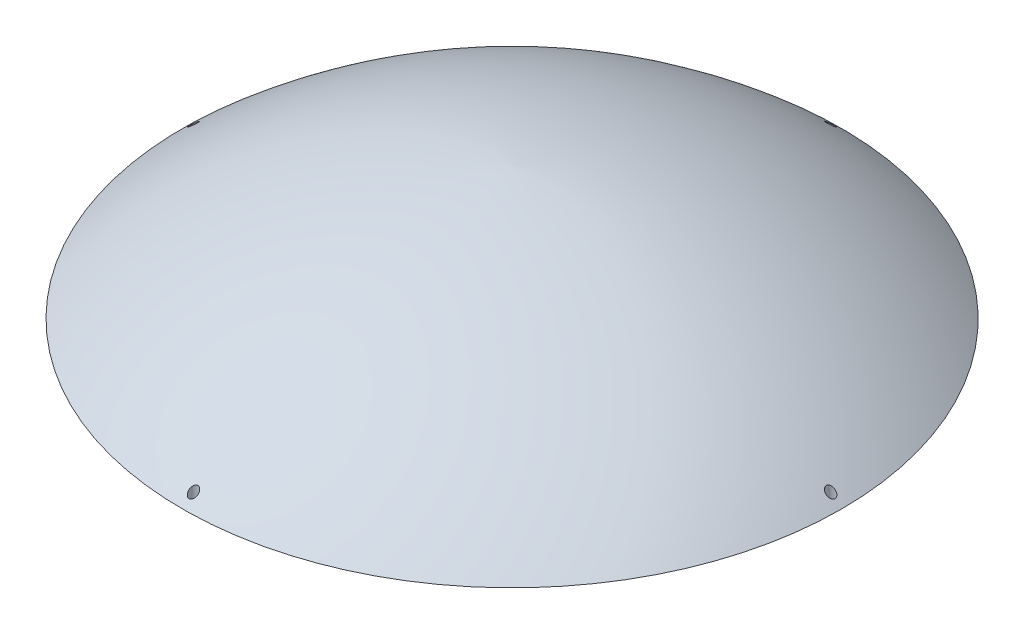
ISO-10303-21;
HEADER;
FILE_DESCRIPTION(('STEP AP214'),'2;1');
FILE_NAME('part.step','',(''),(''),'','','');
FILE_SCHEMA(('AUTOMOTIVE_DESIGN { 1 0 10303 214 1 1 1 1 }'));
ENDSEC;
DATA;
#1=APPLICATION_CONTEXT('core data for automotive mechanical design processes');
#2=APPLICATION_PROTOCOL_DEFINITION('international standard','automotive_design',2000,#1);
#3=PRODUCT_CONTEXT('',#1,'mechanical');
#4=PRODUCT('Part','Part','',(#3));
#5=PRODUCT_RELATED_PRODUCT_CATEGORY('part','',(#4));
#6=PRODUCT_DEFINITION_FORMATION('','',#4);
#7=PRODUCT_DEFINITION_CONTEXT('part definition',#1,'design');
#8=PRODUCT_DEFINITION('design','',#6,#7);
#9=PRODUCT_DEFINITION_SHAPE('','',#8);
#10=(LENGTH_UNIT() NAMED_UNIT(*) SI_UNIT(.MILLI.,.METRE.));
#11=(NAMED_UNIT(*) PLANE_ANGLE_UNIT() SI_UNIT($,.RADIAN.));
#12=(NAMED_UNIT(*) SI_UNIT($,.STERADIAN.) SOLID_ANGLE_UNIT());
#13=UNCERTAINTY_MEASURE_WITH_UNIT(LENGTH_MEASURE(1.E-05),#10,'distance_accuracy_value','');
#14=(GEOMETRIC_REPRESENTATION_CONTEXT(3) GLOBAL_UNCERTAINTY_ASSIGNED_CONTEXT((#13)) GLOBAL_UNIT_ASSIGNED_CONTEXT((#10,
#11,#12)) REPRESENTATION_CONTEXT('',''));
#15=CARTESIAN_POINT('',(0.,0.,0.));
#16=DIRECTION('',(0.,0.,1.));
#17=DIRECTION('',(1.,0.,0.));
#18=AXIS2_PLACEMENT_3D('',#15,#16,#17);
#19=CARTESIAN_POINT('',(-25.734910079613,-379.337275199032,0.));
#20=DIRECTION('',(0.,0.,-1.));
#21=DIRECTION('',(1.,0.,0.));
#22=AXIS2_PLACEMENT_3D('',#19,#20,#21);
#23=CIRCLE('',#22,500.);
#24=TRIMMED_CURVE('',#23,(PARAMETER_VALUE(-1.51930375435487)),
(PARAMETER_VALUE(1.51930375435487)),.T.,.PARAMETER.);
#25=CARTESIAN_POINT('',(0.,-379.337275199032,0.));
#26=DIRECTION('',(0.,-1.,0.));
#27=AXIS1_PLACEMENT('',#25,#26);
#28=SURFACE_OF_REVOLUTION('',#24,#27);
#29=CARTESIAN_POINT('',(292.267910012318,6.48962110392255,-3.2949331064573));
#30=CARTESIAN_POINT('',(292.036218045832,6.6791010805756,-3.45439942666228));
#31=CARTESIAN_POINT('',(291.792467635032,6.87831949702455,-3.58613931641101));
#32=CARTESIAN_POINT('',(291.416813464353,7.18512423822028,-3.74315767288164));
#33=CARTESIAN_POINT('',(291.289619994159,7.28896994773269,-3.78878968035923));
#34=CARTESIAN_POINT('',(291.032757390591,7.4986079612843,-3.86670268112892));
#35=CARTESIAN_POINT('',(290.903088789097,7.6043998469375,-3.89898650975481));
#36=CARTESIAN_POINT('',(290.513871026968,7.92183333053797,-3.97561515687187));
#37=CARTESIAN_POINT('',(290.251867799006,8.13536404002472,-4.00065283273166));
#38=CARTESIAN_POINT('',(289.72782097396,8.56215029133093,-3.9993213831094));
#39=CARTESIAN_POINT('',(289.465777383657,8.77540585884122,-3.97295746654852));
#40=CARTESIAN_POINT('',(289.064091278072,9.10207654610129,-3.89169504431107));
#41=CARTESIAN_POINT('',(288.922207400864,9.21741802944437,-3.85487189917686));
#42=CARTESIAN_POINT('',(288.641503438885,9.44552466567293,-3.76513434376763));
#43=CARTESIAN_POINT('',(288.502684002745,9.5582892733015,-3.71221656121235));
#44=CARTESIAN_POINT('',(288.093080327477,9.89089230363154,-3.52886741596773));
#45=CARTESIAN_POINT('',(287.828393184427,10.1056559310015,-3.37369368337503));
#46=CARTESIAN_POINT('',(287.412505644818,10.4428859627782,-3.05759749422192));
#47=CARTESIAN_POINT('',(287.252639139491,10.572454935075,-2.91539987014728));
#48=CARTESIAN_POINT('',(286.952522464417,10.8156015632706,-2.60001927716397));
#49=CARTESIAN_POINT('',(286.812241019364,10.929204716896,-2.42688674004844));
#50=CARTESIAN_POINT('',(286.581079711342,11.1163463437085,-2.08459726744605));
#51=CARTESIAN_POINT('',(286.485853034323,11.1934154501171,-1.92035220072776));
#52=CARTESIAN_POINT('',(286.359729876266,11.295469558445,-1.66064095266421));
#53=CARTESIAN_POINT('',(286.320463003938,11.3272390097345,-1.57180961301426));
#54=CARTESIAN_POINT('',(286.248053786278,11.385817564669,-1.39012511180292));
#55=CARTESIAN_POINT('',(286.214908744587,11.4126288521424,-1.29727374321395));
#56=CARTESIAN_POINT('',(286.155034746052,11.4610579634418,-1.10735477042745));
#57=CARTESIAN_POINT('',(286.128357975323,11.4826335465982,-1.0102598791584));
#58=CARTESIAN_POINT('',(286.082251191194,11.5199217521549,-0.813305433226634));
#59=CARTESIAN_POINT('',(286.062817588184,11.5356372787162,-0.713447274429294));
#60=CARTESIAN_POINT('',(286.031567361725,11.5609078456787,-0.511808083379131));
#61=CARTESIAN_POINT('',(286.019748154648,11.5704649756755,-0.410027715426245));
#62=CARTESIAN_POINT('',(286.00396424142,11.5832278731941,-0.205468881002917));
#63=CARTESIAN_POINT('',(285.999998563181,11.5864344267723,-0.102690539641578));
#64=CARTESIAN_POINT('',(286.000001261634,11.5864322409967,0.0902136062643329));
#65=CARTESIAN_POINT('',(286.003054133731,11.5839637574694,0.180341442198961));
#66=CARTESIAN_POINT('',(286.015211283645,11.5741335158454,0.359948344122502));
#67=CARTESIAN_POINT('',(286.024317451971,11.5667702290499,0.449427198599309));
#68=CARTESIAN_POINT('',(286.048434251885,11.547268499117,0.627018088593616));
#69=CARTESIAN_POINT('',(286.063442257767,11.5351321794835,0.715130713846184));
#70=CARTESIAN_POINT('',(286.099126561056,11.5062742358141,0.889447888673256));
#71=CARTESIAN_POINT('',(286.119805045767,11.4895508423815,0.975651688050446));
#72=CARTESIAN_POINT('',(286.189378213925,11.4332807675235,1.22858588559347));
#73=CARTESIAN_POINT('',(286.24612114683,11.3873831465826,1.39184564359416));
#74=CARTESIAN_POINT('',(286.377812772175,11.2808402496912,1.70551600983874));
#75=CARTESIAN_POINT('',(286.452765797987,11.2201914634694,1.85592354816579));
#76=CARTESIAN_POINT('',(286.628041369201,11.0783312983801,2.15969287514198));
#77=CARTESIAN_POINT('',(286.73034807054,10.9955101735742,2.31115391102913));
#78=CARTESIAN_POINT('',(286.950202667918,10.8174730930951,2.59441039456338));
#79=CARTESIAN_POINT('',(287.067763671212,10.7222464777235,2.72618871792441));
#80=CARTESIAN_POINT('',(287.374683811438,10.4735479021658,3.02886681264689));
#81=CARTESIAN_POINT('',(287.57121433528,10.314224546575,3.18774834718305));
#82=CARTESIAN_POINT('',(287.981611486035,9.98132989299367,3.46226235312698));
#83=CARTESIAN_POINT('',(288.195504186283,9.80773716108405,3.57782825761775));
#84=CARTESIAN_POINT('',(288.637011791421,9.4491953935222,3.76839898967525));
#85=CARTESIAN_POINT('',(288.864775623936,9.26412245223137,3.8428204138555));
#86=CARTESIAN_POINT('',(289.325920540663,8.88917308355763,3.94989539231856));
#87=CARTESIAN_POINT('',(289.559301899036,8.69929642170774,3.98254690380819));
#88=CARTESIAN_POINT('',(290.071536087071,8.28227930012672,4.00905395728494));
#89=CARTESIAN_POINT('',(290.350647398501,8.05487776825107,3.99441189991257));
#90=CARTESIAN_POINT('',(290.903317188981,7.60425763089688,3.90670022503772));
#91=CARTESIAN_POINT('',(291.176874224774,7.38104011374737,3.83361561575386));
#92=CARTESIAN_POINT('',(291.669002336866,6.979182675434,3.64320880317796));
#93=CARTESIAN_POINT('',(291.889569968476,6.79895808884389,3.53439489868943));
#94=CARTESIAN_POINT('',(292.314112714276,6.45186819486772,3.27214991217307));
#95=CARTESIAN_POINT('',(292.518110302368,6.28498479789143,3.11878059861469));
#96=CARTESIAN_POINT('',(292.858382383913,6.00647959139438,2.80546269988589));
#97=CARTESIAN_POINT('',(292.999637955398,5.89081408735835,2.65453216307032));
#98=CARTESIAN_POINT('',(293.261501834666,5.67631675664249,2.32523979476594));
#99=CARTESIAN_POINT('',(293.382135349541,5.57746437942273,2.14691196589289));
#100=CARTESIAN_POINT('',(293.577661712619,5.41719877357391,1.79804850627584));
#101=CARTESIAN_POINT('',(293.656863299911,5.35226223996047,1.63158796747495));
#102=CARTESIAN_POINT('',(293.758860411341,5.26862233746453,1.37102275557856));
#103=CARTESIAN_POINT('',(293.790065609404,5.24303074408644,1.28232620982904));
#104=CARTESIAN_POINT('',(293.846424956516,5.19680679445442,1.10179036622843));
#105=CARTESIAN_POINT('',(293.871581679024,5.17617232908351,1.00995242402012));
#106=CARTESIAN_POINT('',(293.915574385612,5.14008600344006,0.823132632726926));
#107=CARTESIAN_POINT('',(293.934368983497,5.12466807753311,0.728134453069726));
#108=CARTESIAN_POINT('',(293.96506936419,5.09948253995537,0.536331360997617));
#109=CARTESIAN_POINT('',(293.976978276253,5.08971236162131,0.439527289964526));
#110=CARTESIAN_POINT('',(293.993690154056,5.07600160110084,0.244902967352751));
#111=CARTESIAN_POINT('',(293.998493673224,5.07206056489205,0.147082795514219));
#112=CARTESIAN_POINT('',(294.000901355381,5.07008520111066,-0.0486999900927655));
#113=CARTESIAN_POINT('',(293.998506108606,5.07205038927917,-0.146662591524974));
#114=CARTESIAN_POINT('',(293.987158838361,5.0813600421629,-0.332138195066667));
#115=CARTESIAN_POINT('',(293.978882791418,5.08814992482814,-0.419721253305834));
#116=CARTESIAN_POINT('',(293.956670441867,5.10637278087468,-0.593686310560318));
#117=CARTESIAN_POINT('',(293.94273235205,5.11780722029857,-0.680067921429584));
#118=CARTESIAN_POINT('',(293.892724420442,5.15883024075261,-0.936440140730982));
#119=CARTESIAN_POINT('',(293.848448058906,5.19514907685232,-1.10385834533518));
#120=CARTESIAN_POINT('',(293.739235746083,5.28471713873495,-1.43130881168856));
#121=CARTESIAN_POINT('',(293.673856408588,5.3383296987917,-1.59108936616174));
#122=CARTESIAN_POINT('',(293.525804508055,5.45970731634671,-1.89672983124709));
#123=CARTESIAN_POINT('',(293.443113710955,5.52748729618632,-2.04257482581336));
#124=CARTESIAN_POINT('',(293.226860150817,5.70469746287401,-2.37511227356501));
#125=CARTESIAN_POINT('',(293.08630207856,5.81984178170367,-2.5542141651727));
#126=CARTESIAN_POINT('',(292.784641866736,6.06684744260042,-2.88012269889417));
#127=CARTESIAN_POINT('',(292.623549512385,6.19870082211434,-3.02694463318124));
#128=CARTESIAN_POINT('',(292.393770550655,6.38668190334221,-3.20561125874909));
#129=CARTESIAN_POINT('',(292.331291476057,6.43778711739465,-3.25130963109508));
#130=CARTESIAN_POINT('',(292.267910012318,6.48962110392255,-3.2949331064573));
#131=B_SPLINE_CURVE_WITH_KNOTS('',3,(#29,#30,#31,#32,#33,#34,#35,#36,#37,#38,#39,#40,#41,#42,
#43,#44,#45,#46,#47,#48,#49,#50,#51,#52,#53,#54,#55,#56,#57,#58,#59,#60,#61,#62,#63,#64,#65,#66,
#67,#68,#69,#70,#71,#72,#73,#74,#75,#76,#77,#78,#79,#80,#81,#82,#83,#84,#85,#86,#87,#88,#89,#90,
#91,#92,#93,#94,#95,#96,#97,#98,#99,#100,#101,#102,#103,#104,#105,#106,#107,#108,#109,#110,#111,
#112,#113,#114,#115,#116,#117,#118,#119,#120,#121,#122,#123,#124,#125,#126,#127,#128,#129,#130),
.UNSPECIFIED.,.T.,.F.,(4,2,2,2,2,2,2,2,2,2,2,2,2,2,2,2,2,2,2,2,2,2,2,2,2,2,2,2,2,2,2,2,2,2,2,2,
2,2,2,2,2,2,2,2,2,2,2,2,2,2,4),(0.,1.01709921635975,1.52800291663199,2.03879803822348,
3.05138258611851,4.06386452631818,4.622744441421,5.18174153838819,6.29681427514395,
7.04464219835562,7.79126191386528,8.40326019853619,8.70949657888736,9.01559775417043,
9.32409199760908,9.63243315183852,9.94066962816139,10.2488679494545,10.519175035665,
10.7895665813207,11.0598379666489,11.3302137521833,11.8643188455562,12.398551162189,
12.9983150613295,13.5985977630232,14.4899809132405,15.3827283672929,16.2878294456004,
17.1929747869557,18.2691716492773,19.3456446680158,20.2569470496439,21.1669920462167,
21.8750217169836,22.5821796509954,23.1658774499994,23.4579067869536,23.7498116527987,
24.0435804492113,24.3372156349128,24.630827948643,24.9244161893805,25.1887980894956,
25.4532635060185,25.9815991435611,26.5218495169052,27.0626718219069,27.8239999803884,
28.5849666895362,28.8632035143954),.UNSPECIFIED.);
#132=CARTESIAN_POINT('',(292.267910012318,6.48962110392255,-3.2949331064573));
#133=VERTEX_POINT('',#132);
#134=EDGE_CURVE('E64',#133,#133,#131,.T.);
#135=ORIENTED_EDGE('',*,*,#134,.F.);
#136=EDGE_LOOP('',(#135));
#137=FACE_BOUND('',#136,.T.);
#138=CARTESIAN_POINT('',(-2.7004241601545,5.9307257125656,-292.950882809475));
#139=CARTESIAN_POINT('',(-2.81079349634749,6.01342952912258,-292.849882193364));
#140=CARTESIAN_POINT('',(-2.91388451100399,6.09996996505854,-292.744167664489));
#141=CARTESIAN_POINT('',(-3.10562401809275,6.27922132942429,-292.525131821204));
#142=CARTESIAN_POINT('',(-3.19426887518467,6.37193380279023,-292.411808602186));
#143=CARTESIAN_POINT('',(-3.35747424872209,6.5624137220089,-292.178906172326));
#144=CARTESIAN_POINT('',(-3.43200259625163,6.66019208192202,-292.059313447147));
#145=CARTESIAN_POINT('',(-3.56698084885048,6.85945867088102,-291.815506643293));
#146=CARTESIAN_POINT('',(-3.62743434168651,6.96094594685329,-291.69129375171));
#147=CARTESIAN_POINT('',(-3.77445656385891,7.24333899391225,-291.34554306374));
#148=CARTESIAN_POINT('',(-3.84701769036932,7.42718424453589,-291.120316425648));
#149=CARTESIAN_POINT('',(-3.95133748078044,7.79899551065031,-290.664524348323));
#150=CARTESIAN_POINT('',(-3.9831288706078,7.98695809771691,-290.433963342543));
#151=CARTESIAN_POINT('',(-4.00904064246205,8.40310172655564,-289.923182110604));
#152=CARTESIAN_POINT('',(-3.99393119463491,8.6315021162472,-289.642624905007));
#153=CARTESIAN_POINT('',(-3.9045308855783,9.08363434068812,-289.086825303578));
#154=CARTESIAN_POINT('',(-3.83021416527441,9.30736409168774,-288.811585283865));
#155=CARTESIAN_POINT('',(-3.63781811054328,9.70708159531452,-288.319488420102));
#156=CARTESIAN_POINT('',(-3.52896350714228,9.8848631208516,-288.100482576009));
#157=CARTESIAN_POINT('',(-3.26709582001009,10.2268971882206,-287.678903960985));
#158=CARTESIAN_POINT('',(-3.11414641250132,10.3911688028314,-287.476308029494));
#159=CARTESIAN_POINT('',(-2.80132763181123,10.6656983568649,-287.137567252133));
#160=CARTESIAN_POINT('',(-2.65022270088577,10.7799275101367,-286.99656041526));
#161=CARTESIAN_POINT('',(-2.32070165582242,10.9915262820144,-286.735273086062));
#162=CARTESIAN_POINT('',(-2.14231835475451,11.0889158609206,-286.614968056278));
#163=CARTESIAN_POINT('',(-1.79284521830249,11.2469529669577,-286.419695661069));
#164=CARTESIAN_POINT('',(-1.62571439217867,11.3110349785719,-286.340494172981));
#165=CARTESIAN_POINT('',(-1.36420945734262,11.3934208055213,-286.238654558305));
#166=CARTESIAN_POINT('',(-1.27521000202655,11.4185989721748,-286.207528003871));
#167=CARTESIAN_POINT('',(-1.09409791246948,11.4640187846362,-286.151373906322));
#168=CARTESIAN_POINT('',(-1.00198661254534,11.4842625164268,-286.126343786004));
#169=CARTESIAN_POINT('',(-0.814675270993627,11.51959723291,-286.082652429008));
#170=CARTESIAN_POINT('',(-0.719459697776027,11.5346557080785,-286.064031374981));
#171=CARTESIAN_POINT('',(-0.527260354156879,11.5591751147573,-286.033710143048));
#172=CARTESIAN_POINT('',(-0.430277399036831,11.5686385630514,-286.022006853357));
#173=CARTESIAN_POINT('',(-0.235331763211941,11.5817993262189,-286.005730955408));
#174=CARTESIAN_POINT('',(-0.137369159225205,11.5854970891097,-286.001157793111));
#175=CARTESIAN_POINT('',(0.0586678755179153,11.5870564113264,-285.999229334506));
#176=CARTESIAN_POINT('',(0.156742296909855,11.5849184279628,-286.001873472625));
#177=CARTESIAN_POINT('',(0.342724335492092,11.5753330167126,-286.013727858468));
#178=CARTESIAN_POINT('',(0.430701946713096,11.5684164248761,-286.022281628119));
#179=CARTESIAN_POINT('',(0.605431603502694,11.5499643784737,-286.045100438629));
#180=CARTESIAN_POINT('',(0.692183252459324,11.5384274630638,-286.059367285835));
#181=CARTESIAN_POINT('',(0.949645641041952,11.4971272269006,-286.110437608241));
#182=CARTESIAN_POINT('',(1.11774490845846,11.4606646413074,-286.155522957427));
#183=CARTESIAN_POINT('',(1.44659658363207,11.3708132407168,-286.266603189478));
#184=CARTESIAN_POINT('',(1.60708413753561,11.3170474248611,-286.333063770972));
#185=CARTESIAN_POINT('',(1.91386664366553,11.1953834641959,-286.483419984812));
#186=CARTESIAN_POINT('',(2.06015403601967,11.1274778514968,-286.567324830256));
#187=CARTESIAN_POINT('',(2.39221921296835,10.9506005513952,-286.785817849862));
#188=CARTESIAN_POINT('',(2.57051874367725,10.8360449590566,-286.927282323923));
#189=CARTESIAN_POINT('',(2.89509755987668,10.590086393789,-287.230882425446));
#190=CARTESIAN_POINT('',(3.04131376688674,10.4586510236077,-287.393057799766));
#191=CARTESIAN_POINT('',(3.33647347661793,10.147225108774,-287.777134656448));
#192=CARTESIAN_POINT('',(3.47582681117763,9.96361018975581,-288.003459013026));
#193=CARTESIAN_POINT('',(3.70514694832652,9.58452982092577,-288.470407698864));
#194=CARTESIAN_POINT('',(3.79508801652636,9.38905825478893,-288.711039407375));
#195=CARTESIAN_POINT('',(3.92817666942305,8.98914678876345,-289.203009222633));
#196=CARTESIAN_POINT('',(3.97070050535321,8.78462331677138,-289.454445866936));
#197=CARTESIAN_POINT('',(4.00780321815739,8.37352937372431,-289.959483886018));
#198=CARTESIAN_POINT('',(4.00235531493014,8.16695782361068,-290.213086390962));
#199=CARTESIAN_POINT('',(3.95616150223221,7.84515337538181,-290.60788544423));
#200=CARTESIAN_POINT('',(3.9316615572887,7.72897099530905,-290.750364964614));
#201=CARTESIAN_POINT('',(3.86700187185982,7.49830787090792,-291.033128440827));
#202=CARTESIAN_POINT('',(3.82683912722998,7.38382745739435,-291.173411970089));
#203=CARTESIAN_POINT('',(3.68249095805514,7.04449338428034,-291.589070903084));
#204=CARTESIAN_POINT('',(3.55438369298841,6.8232939790157,-291.859810257273));
#205=CARTESIAN_POINT('',(3.27687858664489,6.45977407263613,-292.304437410387));
#206=CARTESIAN_POINT('',(3.14327121547053,6.31260662388188,-292.484342900245));
#207=CARTESIAN_POINT('',(2.84069875364939,6.03358411403775,-292.825280797966));
#208=CARTESIAN_POINT('',(2.67179241764162,5.90170416719186,-292.986343882486));
#209=CARTESIAN_POINT('',(2.33612651906875,5.68369795376735,-293.252490005204));
#210=CARTESIAN_POINT('',(2.17570844383154,5.59369771537565,-293.36232463898));
#211=CARTESIAN_POINT('',(1.91940575306432,5.47201104465002,-293.510791789941));
#212=CARTESIAN_POINT('',(1.83131826664035,5.43365433892116,-293.557583080949));
#213=CARTESIAN_POINT('',(1.65026275719203,5.36190785169971,-293.645096530512));
#214=CARTESIAN_POINT('',(1.55729698717782,5.32851580415041,-293.685821458));
#215=CARTESIAN_POINT('',(1.36604975355302,5.26692876698786,-293.760925804494));
#216=CARTESIAN_POINT('',(1.26772617306119,5.23878617612453,-293.795241249792));
#217=CARTESIAN_POINT('',(1.06731193373701,5.18862611607502,-293.856398904239));
#218=CARTESIAN_POINT('',(0.965223350502103,5.16660532754128,-293.883245163316));
#219=CARTESIAN_POINT('',(0.758148489542625,5.1291348947772,-293.928924159745));
#220=CARTESIAN_POINT('',(0.653164046366086,5.11368118764024,-293.947761851821));
#221=CARTESIAN_POINT('',(0.44125591679769,5.08967422905276,-293.977024892706));
#222=CARTESIAN_POINT('',(0.334332574526802,5.08111976512836,-293.987451719641));
#223=CARTESIAN_POINT('',(0.135386567479476,5.07184044175384,-293.998761993257));
#224=CARTESIAN_POINT('',(0.0434726518333366,5.07015315489608,-294.000818528946));
#225=CARTESIAN_POINT('',(-0.140258139485547,5.07197662432212,-293.998595985231));
#226=CARTESIAN_POINT('',(-0.232074976563845,5.07548898131702,-293.994314954807));
#227=CARTESIAN_POINT('',(-0.414810000760052,5.08765302723766,-293.979488393197));
#228=CARTESIAN_POINT('',(-0.505728642273307,5.09630196627159,-293.968946213945));
#229=CARTESIAN_POINT('',(-0.68604597507845,5.11858406653374,-293.94178531188));
#230=CARTESIAN_POINT('',(-0.775444068968395,5.13221914147543,-293.925164255951));
#231=CARTESIAN_POINT('',(-1.03246001229854,5.17886003526408,-293.868305837514));
#232=CARTESIAN_POINT('',(-1.19731226055359,5.21820749471359,-293.820334869045));
#233=CARTESIAN_POINT('',(-1.51552776786421,5.31225549769165,-293.705653372143));
#234=CARTESIAN_POINT('',(-1.66888934100435,5.3669582885925,-293.638940100625));
#235=CARTESIAN_POINT('',(-1.98132944762282,5.49742310941844,-293.479793399122));
#236=CARTESIAN_POINT('',(-2.1385049897701,5.57500903503715,-293.385130729175));
#237=CARTESIAN_POINT('',(-2.43389054650418,5.74356561069052,-293.179410321089));
#238=CARTESIAN_POINT('',(-2.57207850471664,5.8345515766203,-293.06833382188));
#239=CARTESIAN_POINT('',(-2.7004241601545,5.9307257125656,-292.950882809475));
#240=B_SPLINE_CURVE_WITH_KNOTS('',3,(#138,#139,#140,#141,#142,#143,#144,#145,#146,#147,#148,
#149,#150,#151,#152,#153,#154,#155,#156,#157,#158,#159,#160,#161,#162,#163,#164,#165,#166,#167,
#168,#169,#170,#171,#172,#173,#174,#175,#176,#177,#178,#179,#180,#181,#182,#183,#184,#185,#186,
#187,#188,#189,#190,#191,#192,#193,#194,#195,#196,#197,#198,#199,#200,#201,#202,#203,#204,#205,
#206,#207,#208,#209,#210,#211,#212,#213,#214,#215,#216,#217,#218,#219,#220,#221,#222,#223,#224,
#225,#226,#227,#228,#229,#230,#231,#232,#233,#234,#235,#236,#237,#238,#239),.UNSPECIFIED.,.T.,
.F.,(4,2,2,2,2,2,2,2,2,2,2,2,2,2,2,2,2,2,2,2,2,2,2,2,2,2,2,2,2,2,2,2,2,2,2,2,2,2,2,2,2,2,2,2,2,
2,2,2,2,2,4),(0.,0.512523296502677,1.02517536974702,1.53898198565357,2.05265748535722,
2.94829951244899,3.84322215546069,4.92461985747432,6.00649012447553,6.91015881812657,
7.81252902714397,8.51834046444085,9.22330946649458,9.8078589690016,10.1003177489772,
10.3926526796917,10.6867884174694,10.9807917447251,11.2747722255833,11.5687296697155,
11.8343939357632,12.1001422653756,12.6311004422059,13.1745141820782,13.718215655505,
14.478472172585,15.2402102839983,16.2042655842051,17.1688224989697,18.1459232364852,
19.123569472566,19.6793487100071,20.2352345990661,21.344875435987,22.1463835135296,
22.9465679685992,23.5865371836239,23.9067933627411,24.2269029131493,24.5500542215789,
24.8730299684816,25.1958056055608,25.5185245056412,25.7940263972595,26.0696131198125,
26.3450524386247,26.6205975840991,27.1466113468194,27.6727021359245,28.2680164765189,
28.8640166037806),.UNSPECIFIED.);
#241=CARTESIAN_POINT('',(-2.7004241601545,5.9307257125656,-292.950882809475));
#242=VERTEX_POINT('',#241);
#243=EDGE_CURVE('E67',#242,#242,#240,.T.);
#244=ORIENTED_EDGE('',*,*,#243,.F.);
#245=EDGE_LOOP('',(#244));
#246=FACE_BOUND('',#245,.T.);
#247=CARTESIAN_POINT('',(-293.327520411326,5.62221036644184,-2.21982159468036));
#248=CARTESIAN_POINT('',(-293.426340003777,5.54123593332856,-2.07168860374766));
#249=CARTESIAN_POINT('',(-293.517014698457,5.46691315701719,-1.91432927901635));
#250=CARTESIAN_POINT('',(-293.678122994521,5.33483213149492,-1.582811485141));
#251=CARTESIAN_POINT('',(-293.748550347398,5.277078995831,-1.40864785214058));
#252=CARTESIAN_POINT('',(-293.83616397412,5.20522289654427,-1.13711184840042));
#253=CARTESIAN_POINT('',(-293.862427615725,5.18368088590592,-1.04452085615391));
#254=CARTESIAN_POINT('',(-293.908382955603,5.14598522380984,-0.856663795814116));
#255=CARTESIAN_POINT('',(-293.928077572671,5.12982917922344,-0.761398936246491));
#256=CARTESIAN_POINT('',(-293.960532272509,5.10320472608818,-0.568952414321429));
#257=CARTESIAN_POINT('',(-293.97329510545,5.09273406187762,-0.471771528025323));
#258=CARTESIAN_POINT('',(-293.991653920452,5.07767220201402,-0.276283961545598));
#259=CARTESIAN_POINT('',(-293.997250530567,5.0730804911246,-0.177977380780792));
#260=CARTESIAN_POINT('',(-294.000999685503,5.07000452691703,0.0104549741540698));
#261=CARTESIAN_POINT('',(-293.999747635486,5.07103177543584,0.100561760829231));
#262=CARTESIAN_POINT('',(-293.991180214574,5.07806079309062,0.280321549645849));
#263=CARTESIAN_POINT('',(-293.983862831346,5.08406421320166,0.369974391245642));
#264=CARTESIAN_POINT('',(-293.963283903435,5.10094721032941,0.548099015654376));
#265=CARTESIAN_POINT('',(-293.950024507401,5.11182502475117,0.636571213489539));
#266=CARTESIAN_POINT('',(-293.917778647242,5.13827763735395,0.811763530763956));
#267=CARTESIAN_POINT('',(-293.898789970552,5.15385425014165,0.898482959479693));
#268=CARTESIAN_POINT('',(-293.834504167777,5.2065850018797,1.15170112370766));
#269=CARTESIAN_POINT('',(-293.781435508534,5.25011078647459,1.31499900530646));
#270=CARTESIAN_POINT('',(-293.657043645028,5.35211377272054,1.62932229516658));
#271=CARTESIAN_POINT('',(-293.585716546855,5.41059416368065,1.78034507650106));
#272=CARTESIAN_POINT('',(-293.418406152051,5.54773669777947,2.08522517427507));
#273=CARTESIAN_POINT('',(-293.320508872865,5.62796413869471,2.23732369116443));
#274=CARTESIAN_POINT('',(-293.109390412071,5.80092206289456,2.5225497638273));
#275=CARTESIAN_POINT('',(-292.996156198073,5.89366317927904,2.65566098568));
#276=CARTESIAN_POINT('',(-292.699207661332,6.13678429193158,2.96304696791055));
#277=CARTESIAN_POINT('',(-292.508139508727,6.29314521557236,3.12554533694521));
#278=CARTESIAN_POINT('',(-292.108039407483,6.62037614747854,3.4082814679862));
#279=CARTESIAN_POINT('',(-291.89897978193,6.79126850496138,3.52845261646623));
#280=CARTESIAN_POINT('',(-291.466343837927,7.14470288445199,3.72927481727328));
#281=CARTESIAN_POINT('',(-291.242601125888,7.32737778271677,3.80932829273866));
#282=CARTESIAN_POINT('',(-290.788667417111,7.69775655754383,3.92849750715596));
#283=CARTESIAN_POINT('',(-290.558476330972,7.88546050382814,3.9676126782432));
#284=CARTESIAN_POINT('',(-290.050656634169,8.29928529104964,4.00929280392109));
#285=CARTESIAN_POINT('',(-289.772557210465,8.52573821951805,4.00321079427984));
#286=CARTESIAN_POINT('',(-289.220422902976,8.9749961383071,3.93315556243276));
#287=CARTESIAN_POINT('',(-288.946389460037,9.19779983823826,3.86916229396826));
#288=CARTESIAN_POINT('',(-288.447587296816,9.60306261388631,3.69457788060996));
#289=CARTESIAN_POINT('',(-288.221231545322,9.78685194259255,3.59161835748217));
#290=CARTESIAN_POINT('',(-287.784340660972,10.1413811724726,3.33979902600624));
#291=CARTESIAN_POINT('',(-287.573784783231,10.3121381900038,3.19100076232948));
#292=CARTESIAN_POINT('',(-287.220899053325,10.5981771285004,2.88419646014969));
#293=CARTESIAN_POINT('',(-287.073750705913,10.7173986687009,2.73541896466778));
#294=CARTESIAN_POINT('',(-286.799924166948,10.9391801616248,2.40930072261535));
#295=CARTESIAN_POINT('',(-286.673220925556,11.0417605043852,2.23199546941622));
#296=CARTESIAN_POINT('',(-286.466800927694,11.2088349720435,1.88410104769668));
#297=CARTESIAN_POINT('',(-286.382739128669,11.2768548924341,1.71782629294777));
#298=CARTESIAN_POINT('',(-286.273533610487,11.3652054338529,1.45683795550326));
#299=CARTESIAN_POINT('',(-286.239938197948,11.392382276521,1.36788193594703));
#300=CARTESIAN_POINT('',(-286.178853788432,11.4417925633045,1.18658181715567));
#301=CARTESIAN_POINT('',(-286.151362175422,11.4640281252108,1.09423918923907));
#302=CARTESIAN_POINT('',(-286.102764642256,11.5033322138359,0.906123050460614));
#303=CARTESIAN_POINT('',(-286.081702665579,11.5203651837567,0.810330722235867));
#304=CARTESIAN_POINT('',(-286.046598641479,11.5487529881802,0.616680031641654));
#305=CARTESIAN_POINT('',(-286.032553341999,11.5601104531411,0.518822648334233));
#306=CARTESIAN_POINT('',(-286.011739713374,11.5769406928723,0.321847926891555));
#307=CARTESIAN_POINT('',(-286.00497025451,11.5824143812164,0.222730786777596));
#308=CARTESIAN_POINT('',(-285.998839233147,11.5873718468917,0.0241240094870105));
#309=CARTESIAN_POINT('',(-285.999476992685,11.586856172414,-0.0753655927658605));
#310=CARTESIAN_POINT('',(-286.007693022421,11.5802127722834,-0.26342201972465));
#311=CARTESIAN_POINT('',(-286.014538258594,11.5746777729616,-0.352042725146301));
#312=CARTESIAN_POINT('',(-286.034039052212,11.5589090467886,-0.528228384871493));
#313=CARTESIAN_POINT('',(-286.046696444918,11.5486738357867,-0.615792996730749));
#314=CARTESIAN_POINT('',(-286.093122152699,11.5111306246756,-0.875918086426819));
#315=CARTESIAN_POINT('',(-286.135352450339,11.4769782147045,-1.0460918060291));
#316=CARTESIAN_POINT('',(-286.240666623295,11.3917943505488,-1.37773196747334));
#317=CARTESIAN_POINT('',(-286.304009759253,11.3405530440895,-1.53905956759287));
#318=CARTESIAN_POINT('',(-286.44837025565,11.2237472904724,-1.84797520654587));
#319=CARTESIAN_POINT('',(-286.529392746662,11.1581786855052,-1.99555923920148));
#320=CARTESIAN_POINT('',(-286.718282097292,11.0052776862107,-2.29473571228988));
#321=CARTESIAN_POINT('',(-286.828312317908,10.9161890798535,-2.44405558744089));
#322=CARTESIAN_POINT('',(-287.063211781091,10.7259329291828,-2.72184436087409));
#323=CARTESIAN_POINT('',(-287.188094243259,10.6247546237538,-2.85029443924819));
#324=CARTESIAN_POINT('',(-287.513538550253,10.3609856921285,-3.14426821481889));
#325=CARTESIAN_POINT('',(-287.721114222542,10.1926644598096,-3.29695625269743));
#326=CARTESIAN_POINT('',(-288.152670543996,9.84250560140931,-3.55682725080482));
#327=CARTESIAN_POINT('',(-288.376675377598,9.66064804317105,-3.66394148167174));
#328=CARTESIAN_POINT('',(-288.837340346128,9.28642014334854,-3.83527852845457));
#329=CARTESIAN_POINT('',(-289.074127794437,9.09394331794632,-3.8989212842261));
#330=CARTESIAN_POINT('',(-289.552104604992,8.70515490607642,-3.98224376820906));
#331=CARTESIAN_POINT('',(-289.793294274497,8.50884305186923,-4.00192041581705));
#332=CARTESIAN_POINT('',(-290.316748713072,8.08250450118428,-3.99742993496361));
#333=CARTESIAN_POINT('',(-290.598967313148,7.85246695259446,-3.96516897445227));
#334=CARTESIAN_POINT('',(-291.15536599467,7.39859883365612,-3.84010582061736));
#335=CARTESIAN_POINT('',(-291.429543371822,7.17477035278224,-3.7472834987853));
#336=CARTESIAN_POINT('',(-291.906756189811,6.78491237879892,-3.52406828175899));
#337=CARTESIAN_POINT('',(-292.113005978792,6.61631488747157,-3.40499276825702));
#338=CARTESIAN_POINT('',(-292.507623583401,6.29356641019166,-3.1256874438379));
#339=CARTESIAN_POINT('',(-292.696048142595,6.13936960365521,-2.96559468581285));
#340=CARTESIAN_POINT('',(-292.953859558744,5.92829344105811,-2.69976800458181));
#341=CARTESIAN_POINT('',(-293.033409384283,5.86314853489497,-2.61019188906502));
#342=CARTESIAN_POINT('',(-293.185800722566,5.73832697088921,-2.42184801979933));
#343=CARTESIAN_POINT('',(-293.258639225063,5.6786527668961,-2.323076181014));
#344=CARTESIAN_POINT('',(-293.327520411326,5.62221036644184,-2.21982159468036));
#345=B_SPLINE_CURVE_WITH_KNOTS('',3,(#247,#248,#249,#250,#251,#252,#253,#254,#255,#256,#257,
#258,#259,#260,#261,#262,#263,#264,#265,#266,#267,#268,#269,#270,#271,#272,#273,#274,#275,#276,
#277,#278,#279,#280,#281,#282,#283,#284,#285,#286,#287,#288,#289,#290,#291,#292,#293,#294,#295,
#296,#297,#298,#299,#300,#301,#302,#303,#304,#305,#306,#307,#308,#309,#310,#311,#312,#313,#314,
#315,#316,#317,#318,#319,#320,#321,#322,#323,#324,#325,#326,#327,#328,#329,#330,#331,#332,#333,
#334,#335,#336,#337,#338,#339,#340,#341,#342,#343,#344),.UNSPECIFIED.,.T.,.F.,(4,2,2,2,2,2,2,2,
2,2,2,2,2,2,2,2,2,2,2,2,2,2,2,2,2,2,2,2,2,2,2,2,2,2,2,2,2,2,2,2,2,2,2,2,2,2,2,2,4),(0.,
0.586480147260359,1.17314109360345,1.46867888232785,1.76408518014579,2.05937419039193,
2.35463731949049,2.62466226928632,2.89477684279707,3.16479382082544,3.43491520921951,
3.96394248351159,4.49308267556344,5.08450690467448,5.67643688026858,6.55832316196602,
7.44159119744242,8.33765161486014,9.23372446157425,10.3050902481311,11.3768270349848,
12.3009573096124,13.2238521833153,13.9436978690251,14.6626547733011,15.255020579379,
15.5513945935509,15.8476413383038,16.1458696569286,16.4439596255003,16.7420033029683,
17.0400197014732,17.3068602657809,17.5737851463355,18.107094899903,18.6472108947811,
19.1874838410221,19.802536746796,20.4181412512809,21.3365041825651,22.2562472196599,
23.1880348799734,24.119887826445,25.2114778496873,26.3034308647646,27.17567417287,
28.0450401807716,28.4536577741299,28.8624577626872),.UNSPECIFIED.);
#346=CARTESIAN_POINT('',(-293.327520411326,5.62221036644184,-2.21982159468036));
#347=VERTEX_POINT('',#346);
#348=EDGE_CURVE('E94',#347,#347,#345,.T.);
#349=ORIENTED_EDGE('',*,*,#348,.F.);
#350=EDGE_LOOP('',(#349));
#351=FACE_BOUND('',#350,.T.);
#352=CARTESIAN_POINT('',(-3.46269667992731,6.70667933909338,292.002431447721));
#353=CARTESIAN_POINT('',(-3.35020168749078,6.54767366985336,292.196954644109));
#354=CARTESIAN_POINT('',(-3.21940288871472,6.39359363176604,292.3853469558));
#355=CARTESIAN_POINT('',(-2.92013654331237,6.10045316410638,292.743595975597));
#356=CARTESIAN_POINT('',(-2.75164462676079,5.96140253822983,292.913440585764));
#357=CARTESIAN_POINT('',(-2.41700308569689,5.7324880227791,293.192937004142));
#358=CARTESIAN_POINT('',(-2.25804469032702,5.63846262828069,293.3076961118));
#359=CARTESIAN_POINT('',(-2.0032369097024,5.5106382111871,293.463666182197));
#360=CARTESIAN_POINT('',(-1.91555602305835,5.4702265005075,293.512968574273));
#361=CARTESIAN_POINT('',(-1.73504435832993,5.39434198212296,293.605536666789));
#362=CARTESIAN_POINT('',(-1.64221599645547,5.3588668841756,293.64880516655));
#363=CARTESIAN_POINT('',(-1.45088681403324,5.29307047729547,293.729047916267));
#364=CARTESIAN_POINT('',(-1.35233809424722,5.26280495928847,293.765954035361));
#365=CARTESIAN_POINT('',(-1.15114316756418,5.2084399210696,293.832241907051));
#366=CARTESIAN_POINT('',(-1.04849925851414,5.184336997693,293.861627812535));
#367=CARTESIAN_POINT('',(-0.839969398667266,5.14278624965502,293.912282795104));
#368=CARTESIAN_POINT('',(-0.734085394608388,5.1253345104165,293.933556646571));
#369=CARTESIAN_POINT('',(-0.520044544595667,5.09746452627261,293.967529234372));
#370=CARTESIAN_POINT('',(-0.411888136244284,5.0870449397398,293.980229606396));
#371=CARTESIAN_POINT('',(-0.210886371599616,5.07450858164181,293.995509922549));
#372=CARTESIAN_POINT('',(-0.118195577127353,5.07137552641745,293.999328635384));
#373=CARTESIAN_POINT('',(0.0672870999394694,5.07040679169101,294.00050938342));
#374=CARTESIAN_POINT('',(0.160079004873846,5.07257274380034,293.997869429939));
#375=CARTESIAN_POINT('',(0.344930311351437,5.08216720297936,293.986175008698));
#376=CARTESIAN_POINT('',(0.436990115038179,5.08959258521529,293.977124349788));
#377=CARTESIAN_POINT('',(0.619728881032418,5.10956638121685,293.952777602693));
#378=CARTESIAN_POINT('',(0.710407301880027,5.1221167528179,293.937479127732));
#379=CARTESIAN_POINT('',(0.969353797685176,5.16549435904162,293.884600219395));
#380=CARTESIAN_POINT('',(1.13507790906975,5.20265782510933,293.839293398102));
#381=CARTESIAN_POINT('',(1.45545425887265,5.29256483462123,293.729665784823));
#382=CARTESIAN_POINT('',(1.61010491271804,5.34531060232473,293.665342278342));
#383=CARTESIAN_POINT('',(1.92030148755804,5.46975409021606,293.513548729137));
#384=CARTESIAN_POINT('',(2.07451222853212,5.54278382372262,293.424450977041));
#385=CARTESIAN_POINT('',(2.36530928090734,5.70173438208745,293.230470891591));
#386=CARTESIAN_POINT('',(2.50188122789225,5.78766559184714,293.125575842163));
#387=CARTESIAN_POINT('',(2.81738685913498,6.01304975736217,292.850361371975));
#388=CARTESIAN_POINT('',(2.98560584766078,6.1585300795762,292.672641126998));
#389=CARTESIAN_POINT('',(3.28250974388809,6.46475489780392,292.298347452779));
#390=CARTESIAN_POINT('',(3.41112992286763,6.62552382930663,292.10174383742));
#391=CARTESIAN_POINT('',(3.63156223109924,6.95952694466952,291.693055007183));
#392=CARTESIAN_POINT('',(3.72278880538842,7.1329127766993,291.480780747681));
#393=CARTESIAN_POINT('',(3.86681362757433,7.48567647734392,291.048633197209));
#394=CARTESIAN_POINT('',(3.9196223509125,7.66505269858911,290.828761994847));
#395=CARTESIAN_POINT('',(3.99494997811836,8.0650078150489,290.338212955858));
#396=CARTESIAN_POINT('',(4.00862999064131,8.28623057230427,290.066681568238));
#397=CARTESIAN_POINT('',(3.98092264118587,8.72754668994753,289.524602327537));
#398=CARTESIAN_POINT('',(3.9394465634764,8.94763765784647,289.254056762518));
#399=CARTESIAN_POINT('',(3.8328308182232,9.27903843799301,288.846392938491));
#400=CARTESIAN_POINT('',(3.78782688978113,9.39308851301482,288.706042451726));
#401=CARTESIAN_POINT('',(3.68160002422628,9.6180872504948,288.429055875681));
#402=CARTESIAN_POINT('',(3.62037362585366,9.72903524549521,288.29242058595));
#403=CARTESIAN_POINT('',(3.41197274795671,10.055108773439,287.890707793252));
#404=CARTESIAN_POINT('',(3.2398203131982,10.2642946291048,287.632801269868));
#405=CARTESIAN_POINT('',(2.90063363704331,10.584220512234,287.238122065815));
#406=CARTESIAN_POINT('',(2.75355568829355,10.7035128597803,287.090890757752));
#407=CARTESIAN_POINT('',(2.43104446047038,10.9257601772881,286.816497185164));
#408=CARTESIAN_POINT('',(2.25565463672622,11.0287397130018,286.689304745354));
#409=CARTESIAN_POINT('',(1.90995177002231,11.1976045623532,286.480678465922));
#410=CARTESIAN_POINT('',(1.74377776103192,11.2668170763712,286.395144801106));
#411=CARTESIAN_POINT('',(1.48269254422428,11.3569511140047,286.283736962316));
#412=CARTESIAN_POINT('',(1.39365846937799,11.3847227081273,286.24940693162));
#413=CARTESIAN_POINT('',(1.21211741149552,11.4353100643421,286.186868319939));
#414=CARTESIAN_POINT('',(1.11961194139749,11.4581279566494,286.158657107715));
#415=CARTESIAN_POINT('',(0.931069025334323,11.4985813571848,286.108639093612));
#416=CARTESIAN_POINT('',(0.835011794797457,11.5161804623007,286.086877279436));
#417=CARTESIAN_POINT('',(0.64074396207025,11.5456654646507,286.050416764576));
#418=CARTESIAN_POINT('',(0.542534391082938,11.5575540378709,286.03571475563));
#419=CARTESIAN_POINT('',(0.344777008908118,11.5753999906232,286.013645113849));
#420=CARTESIAN_POINT('',(0.24522946130085,11.5813585215024,286.006276057285));
#421=CARTESIAN_POINT('',(0.0456901867981456,11.5872294585315,285.999015332734));
#422=CARTESIAN_POINT('',(-0.0543014964221494,11.5871424465745,285.999122945106));
#423=CARTESIAN_POINT('',(-0.243040211103446,11.5812603603427,286.006397452964));
#424=CARTESIAN_POINT('',(-0.331836835583251,11.5760819554798,286.012801700128));
#425=CARTESIAN_POINT('',(-0.50841848997366,11.561004662121,286.03144748695));
#426=CARTESIAN_POINT('',(-0.596203192328108,11.5511042867755,286.043690865228));
#427=CARTESIAN_POINT('',(-0.857044200603715,11.5145259198649,286.088923728738));
#428=CARTESIAN_POINT('',(-1.02777207038507,11.4809645342236,286.130423556282));
#429=CARTESIAN_POINT('',(-1.36014677969899,11.3969656939806,286.234273694081));
#430=CARTESIAN_POINT('',(-1.5216868436807,11.3463642731417,286.296826582196));
#431=CARTESIAN_POINT('',(-1.83114789718108,11.2307886237404,286.439668808484));
#432=CARTESIAN_POINT('',(-1.97906501438912,11.1658103263119,286.519963167743));
#433=CARTESIAN_POINT('',(-2.27879345769832,11.0142398370874,286.707212224623));
#434=CARTESIAN_POINT('',(-2.42837662973036,10.9259076500928,286.816310471537));
#435=CARTESIAN_POINT('',(-2.70683958386253,10.7371248733903,287.049396207287));
#436=CARTESIAN_POINT('',(-2.83570037810516,10.6366633154577,287.17339717173));
#437=CARTESIAN_POINT('',(-3.13078562541466,10.374684095089,287.496642296293));
#438=CARTESIAN_POINT('',(-3.28426546105904,10.207417500026,287.702923914927));
#439=CARTESIAN_POINT('',(-3.54596415259696,9.85929342964841,288.131987392181));
#440=CARTESIAN_POINT('',(-3.65412071426778,9.67841764916889,288.354791468477));
#441=CARTESIAN_POINT('',(-3.82780153071188,9.30612100404824,288.813098228998));
#442=CARTESIAN_POINT('',(-3.89275761653801,9.11459417968787,289.048727681156));
#443=CARTESIAN_POINT('',(-3.97903887118524,8.72737237264896,289.524801117066));
#444=CARTESIAN_POINT('',(-4.00032999097307,8.53167425733162,289.765248710498));
#445=CARTESIAN_POINT('',(-3.99979998236496,8.22096742818927,290.146752026647));
#446=CARTESIAN_POINT('',(-3.99212753777468,8.10593476618578,290.287940820153));
#447=CARTESIAN_POINT('',(-3.96181029614245,7.87660604038287,290.569306488659));
#448=CARTESIAN_POINT('',(-3.93916147484129,7.76231018290563,290.709483081435));
#449=CARTESIAN_POINT('',(-3.84864340106819,7.42233829177165,291.126276934182));
#450=CARTESIAN_POINT('',(-3.75820332671845,7.19866552551957,291.400278541438));
#451=CARTESIAN_POINT('',(-3.58461021913303,6.8889376941463,291.779427659635));
#452=CARTESIAN_POINT('',(-3.52660731941411,6.79701361782931,291.891918956392));
#453=CARTESIAN_POINT('',(-3.46269667992731,6.70667933909338,292.002431447721));
#454=B_SPLINE_CURVE_WITH_KNOTS('',3,(#352,#353,#354,#355,#356,#357,#358,#359,#360,#361,#362,
#363,#364,#365,#366,#367,#368,#369,#370,#371,#372,#373,#374,#375,#376,#377,#378,#379,#380,#381,
#382,#383,#384,#385,#386,#387,#388,#389,#390,#391,#392,#393,#394,#395,#396,#397,#398,#399,#400,
#401,#402,#403,#404,#405,#406,#407,#408,#409,#410,#411,#412,#413,#414,#415,#416,#417,#418,#419,
#420,#421,#422,#423,#424,#425,#426,#427,#428,#429,#430,#431,#432,#433,#434,#435,#436,#437,#438,
#439,#440,#441,#442,#443,#444,#445,#446,#447,#448,#449,#450,#451,#452,#453),.UNSPECIFIED.,.T.,
.F.,(4,2,2,2,2,2,2,2,2,2,2,2,2,2,2,2,2,2,2,2,2,2,2,2,2,2,2,2,2,2,2,2,2,2,2,2,2,2,2,2,2,2,2,2,2,
2,2,2,2,2,4),(0.,0.825479941209102,1.65149513461781,2.30102478846001,2.62590210597828,
2.95062819708905,3.27864059477537,3.60647146128562,3.93410908275642,4.26168417828455,
4.53978681958294,4.81797510193056,5.09599824019868,5.37412768766807,5.89903480483047,
6.42401688486873,6.99932180961455,7.57509232742955,8.42450187548178,9.27529259644261,
10.1389391789022,11.0023501814583,12.0495250869865,13.0983863583006,13.6567680209945,
14.2152689172301,15.3283026043702,16.0454711913451,16.7615492981606,17.3567727988601,
17.6546039925251,17.9523068565491,18.2520399423478,18.5516324342403,18.8511667474141,
19.1506722299769,19.4178738078212,19.6851595774455,20.2191834154353,20.7585001014756,
21.2979696176996,21.9111311821776,22.5248514224035,23.4400753625658,24.3565531317611,
25.2848577789978,26.2138860241016,26.7601372859118,27.3065353890104,28.3950454637789,
28.8640170133879),.UNSPECIFIED.);
#455=CARTESIAN_POINT('',(-3.46269667992731,6.70667933909338,292.002431447721));
#456=VERTEX_POINT('',#455);
#457=EDGE_CURVE('E101',#456,#456,#454,.T.);
#458=ORIENTED_EDGE('',*,*,#457,.F.);
#459=EDGE_LOOP('',(#458));
#460=FACE_BOUND('',#459,.T.);
#461=CARTESIAN_POINT('',(0.,120.,0.));
#462=VERTEX_POINT('',#461);
#463=VERTEX_LOOP('',#462);
#464=FACE_BOUND('',#463,.T.);
#465=CARTESIAN_POINT('',(0.,0.,0.));
#466=DIRECTION('',(0.,-1.,0.));
#467=DIRECTION('',(1.,0.,0.));
#468=AXIS2_PLACEMENT_3D('',#465,#466,#467);
#469=CIRCLE('',#468,300.);
#470=CARTESIAN_POINT('',(300.,0.,0.));
#471=VERTEX_POINT('',#470);
#472=EDGE_CURVE('E11',#471,#471,#469,.T.);
#473=ORIENTED_EDGE('',*,*,#472,.F.);
#474=EDGE_LOOP('',(#473));
#475=FACE_BOUND('',#474,.T.);
#476=ADVANCED_FACE('F39',(#137,#246,#351,#460,#464,#475),#28,.T.);
#477=CARTESIAN_POINT('',(0.,0.,0.));
#478=DIRECTION('',(0.,-1.,0.));
#479=DIRECTION('',(1.,0.,0.));
#480=AXIS2_PLACEMENT_3D('',#477,#478,#479);
#481=PLANE('',#480);
#482=CARTESIAN_POINT('',(290.,0.,0.));
#483=DIRECTION('',(0.,-1.,0.));
#484=DIRECTION('',(1.,0.,0.));
#485=AXIS2_PLACEMENT_3D('',#482,#483,#484);
#486=CIRCLE('',#485,3.99999999999999);
#487=CARTESIAN_POINT('',(294.,0.,0.));
#488=VERTEX_POINT('',#487);
#489=EDGE_CURVE('E108',#488,#488,#486,.T.);
#490=ORIENTED_EDGE('',*,*,#489,.F.);
#491=EDGE_LOOP('',(#490));
#492=FACE_BOUND('',#491,.T.);
#493=CARTESIAN_POINT('',(0.,0.,-290.));
#494=DIRECTION('',(0.,-1.,0.));
#495=DIRECTION('',(1.,0.,0.));
#496=AXIS2_PLACEMENT_3D('',#493,#494,#495);
#497=CIRCLE('',#496,3.99999999999999);
#498=CARTESIAN_POINT('',(3.99999999999997,0.,-290.));
#499=VERTEX_POINT('',#498);
#500=EDGE_CURVE('E117',#499,#499,#497,.T.);
#501=ORIENTED_EDGE('',*,*,#500,.F.);
#502=EDGE_LOOP('',(#501));
#503=FACE_BOUND('',#502,.T.);
#504=CARTESIAN_POINT('',(-290.,0.,0.));
#505=DIRECTION('',(0.,-1.,0.));
#506=DIRECTION('',(1.,0.,0.));
#507=AXIS2_PLACEMENT_3D('',#504,#505,#506);
#508=CIRCLE('',#507,3.99999999999999);
#509=CARTESIAN_POINT('',(-286.,0.,0.));
#510=VERTEX_POINT('',#509);
#511=EDGE_CURVE('E113',#510,#510,#508,.T.);
#512=ORIENTED_EDGE('',*,*,#511,.F.);
#513=EDGE_LOOP('',(#512));
#514=FACE_BOUND('',#513,.T.);
#515=CARTESIAN_POINT('',(0.,0.,290.));
#516=DIRECTION('',(0.,-1.,0.));
#517=DIRECTION('',(1.,0.,0.));
#518=AXIS2_PLACEMENT_3D('',#515,#516,#517);
#519=CIRCLE('',#518,3.99999999999998);
#520=CARTESIAN_POINT('',(3.99999999999997,0.,290.));
#521=VERTEX_POINT('',#520);
#522=EDGE_CURVE('E109',#521,#521,#519,.T.);
#523=ORIENTED_EDGE('',*,*,#522,.F.);
#524=EDGE_LOOP('',(#523));
#525=FACE_BOUND('',#524,.T.);
#526=CARTESIAN_POINT('',(0.,0.,0.));
#527=DIRECTION('',(0.,-1.,0.));
#528=DIRECTION('',(1.,0.,0.));
#529=AXIS2_PLACEMENT_3D('',#526,#527,#528);
#530=CIRCLE('',#529,268.379407226726);
#531=CARTESIAN_POINT('',(268.379407226726,0.,0.));
#532=VERTEX_POINT('',#531);
#533=EDGE_CURVE('E48',#532,#532,#530,.T.);
#534=ORIENTED_EDGE('',*,*,#533,.F.);
#535=EDGE_LOOP('',(#534));
#536=FACE_BOUND('',#535,.T.);
#537=ORIENTED_EDGE('',*,*,#472,.T.);
#538=EDGE_LOOP('',(#537));
#539=FACE_BOUND('',#538,.T.);
#540=ADVANCED_FACE('F58',(#492,#503,#514,#525,#536,#539),#481,.T.);
#541=CARTESIAN_POINT('',(-25.734910079613,-379.337275199032,0.));
#542=DIRECTION('',(0.,0.,-1.));
#543=DIRECTION('',(1.,0.,0.));
#544=AXIS2_PLACEMENT_3D('',#541,#542,#543);
#545=CIRCLE('',#544,480.);
#546=TRIMMED_CURVE('',#545,(PARAMETER_VALUE(-1.51715621171903)),
(PARAMETER_VALUE(1.51715621171903)),.T.,.PARAMETER.);
#547=CARTESIAN_POINT('',(0.,-379.337275199032,0.));
#548=DIRECTION('',(0.,-1.,0.));
#549=AXIS1_PLACEMENT('',#547,#548);
#550=SURFACE_OF_REVOLUTION('',#546,#549);
#551=CARTESIAN_POINT('',(0.,99.97234749093,0.));
#552=VERTEX_POINT('',#551);
#553=VERTEX_LOOP('',#552);
#554=FACE_BOUND('',#553,.T.);
#555=ORIENTED_EDGE('',*,*,#533,.T.);
#556=EDGE_LOOP('',(#555));
#557=FACE_BOUND('',#556,.T.);
#558=ADVANCED_FACE('F54',(#554,#557),#550,.F.);
#559=CARTESIAN_POINT('',(0.,120.,290.));
#560=DIRECTION('',(0.,-1.,0.));
#561=DIRECTION('',(1.,0.,0.));
#562=AXIS2_PLACEMENT_3D('',#559,#560,#561);
#563=CYLINDRICAL_SURFACE('',#562,3.99999999999998);
#564=ORIENTED_EDGE('',*,*,#457,.T.);
#565=EDGE_LOOP('',(#564));
#566=FACE_BOUND('',#565,.T.);
#567=ORIENTED_EDGE('',*,*,#522,.T.);
#568=EDGE_LOOP('',(#567));
#569=FACE_BOUND('',#568,.T.);
#570=ADVANCED_FACE('F57',(#566,#569),#563,.F.);
#571=CARTESIAN_POINT('',(-290.,120.,0.));
#572=DIRECTION('',(0.,-1.,0.));
#573=DIRECTION('',(1.,0.,0.));
#574=AXIS2_PLACEMENT_3D('',#571,#572,#573);
#575=CYLINDRICAL_SURFACE('',#574,3.99999999999999);
#576=ORIENTED_EDGE('',*,*,#348,.T.);
#577=EDGE_LOOP('',(#576));
#578=FACE_BOUND('',#577,.T.);
#579=ORIENTED_EDGE('',*,*,#511,.T.);
#580=EDGE_LOOP('',(#579));
#581=FACE_BOUND('',#580,.T.);
#582=ADVANCED_FACE('F87',(#578,#581),#575,.F.);
#583=CARTESIAN_POINT('',(0.,120.,-290.));
#584=DIRECTION('',(0.,-1.,0.));
#585=DIRECTION('',(1.,0.,0.));
#586=AXIS2_PLACEMENT_3D('',#583,#584,#585);
#587=CYLINDRICAL_SURFACE('',#586,3.99999999999999);
#588=ORIENTED_EDGE('',*,*,#243,.T.);
#589=EDGE_LOOP('',(#588));
#590=FACE_BOUND('',#589,.T.);
#591=ORIENTED_EDGE('',*,*,#500,.T.);
#592=EDGE_LOOP('',(#591));
#593=FACE_BOUND('',#592,.T.);
#594=ADVANCED_FACE('F82',(#590,#593),#587,.F.);
#595=CARTESIAN_POINT('',(290.,120.,0.));
#596=DIRECTION('',(0.,-1.,0.));
#597=DIRECTION('',(1.,0.,0.));
#598=AXIS2_PLACEMENT_3D('',#595,#596,#597);
#599=CYLINDRICAL_SURFACE('',#598,3.99999999999999);
#600=ORIENTED_EDGE('',*,*,#134,.T.);
#601=EDGE_LOOP('',(#600));
#602=FACE_BOUND('',#601,.T.);
#603=ORIENTED_EDGE('',*,*,#489,.T.);
#604=EDGE_LOOP('',(#603));
#605=FACE_BOUND('',#604,.T.);
#606=ADVANCED_FACE('F79',(#602,#605),#599,.F.);
#607=CLOSED_SHELL('',(#476,#540,#558,#570,#582,#594,#606));
#608=MANIFOLD_SOLID_BREP('B2',#607);
#609=ADVANCED_BREP_SHAPE_REPRESENTATION('',(#18,#608),#14);
#610=SHAPE_DEFINITION_REPRESENTATION(#9,#609);
ENDSEC;
END-ISO-10303-21;
